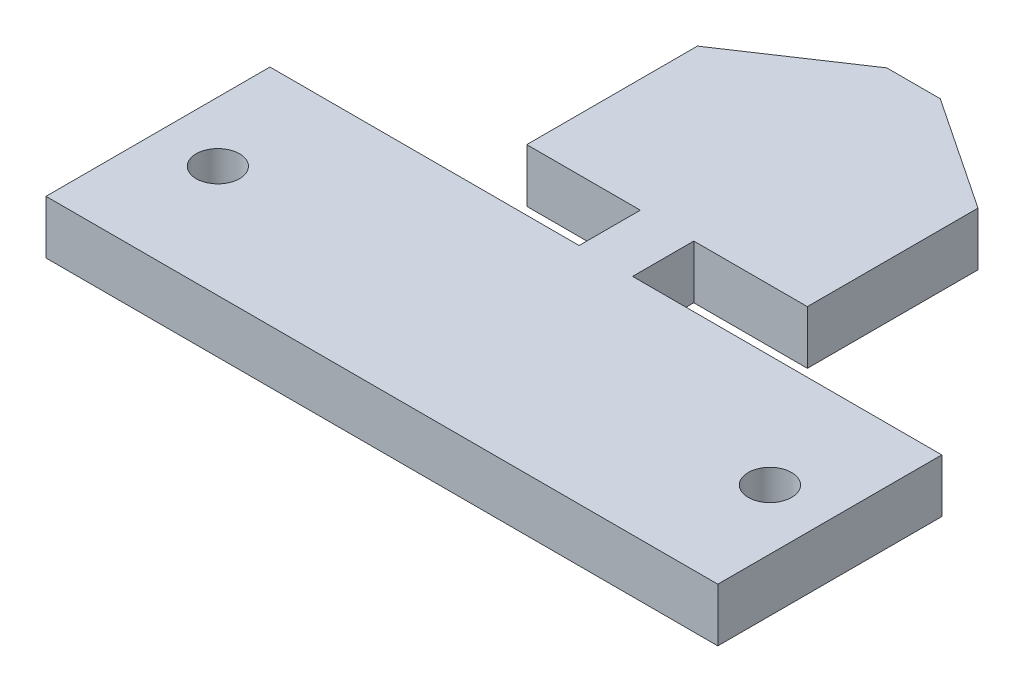
ISO-10303-21;
HEADER;
FILE_DESCRIPTION(('STEP AP214'),'2;1');
FILE_NAME('part.step','',(''),(''),'','','');
FILE_SCHEMA(('AUTOMOTIVE_DESIGN { 1 0 10303 214 1 1 1 1 }'));
ENDSEC;
DATA;
#1=APPLICATION_CONTEXT('core data for automotive mechanical design processes');
#2=APPLICATION_PROTOCOL_DEFINITION('international standard','automotive_design',2000,#1);
#3=PRODUCT_CONTEXT('',#1,'mechanical');
#4=PRODUCT('Part','Part','',(#3));
#5=PRODUCT_RELATED_PRODUCT_CATEGORY('part','',(#4));
#6=PRODUCT_DEFINITION_FORMATION('','',#4);
#7=PRODUCT_DEFINITION_CONTEXT('part definition',#1,'design');
#8=PRODUCT_DEFINITION('design','',#6,#7);
#9=PRODUCT_DEFINITION_SHAPE('','',#8);
#10=(LENGTH_UNIT() NAMED_UNIT(*) SI_UNIT(.MILLI.,.METRE.));
#11=(NAMED_UNIT(*) PLANE_ANGLE_UNIT() SI_UNIT($,.RADIAN.));
#12=(NAMED_UNIT(*) SI_UNIT($,.STERADIAN.) SOLID_ANGLE_UNIT());
#13=UNCERTAINTY_MEASURE_WITH_UNIT(LENGTH_MEASURE(1.E-05),#10,'distance_accuracy_value','');
#14=(GEOMETRIC_REPRESENTATION_CONTEXT(3) GLOBAL_UNCERTAINTY_ASSIGNED_CONTEXT((#13)) GLOBAL_UNIT_ASSIGNED_CONTEXT((#10,
#11,#12)) REPRESENTATION_CONTEXT('',''));
#15=CARTESIAN_POINT('',(0.,0.,0.));
#16=DIRECTION('',(0.,0.,1.));
#17=DIRECTION('',(1.,0.,0.));
#18=AXIS2_PLACEMENT_3D('',#15,#16,#17);
#19=CARTESIAN_POINT('',(0.,3.5814,17.05));
#20=DIRECTION('',(0.,0.,-1.));
#21=DIRECTION('',(-1.,0.,0.));
#22=AXIS2_PLACEMENT_3D('',#19,#20,#21);
#23=PLANE('',#22);
#24=DIRECTION('',(1.,0.,0.));
#25=VECTOR('',#24,1.);
#26=CARTESIAN_POINT('',(0.,0.,17.05));
#27=LINE('',#26,#25);
#28=CARTESIAN_POINT('',(-22.5,0.,17.05));
#29=VERTEX_POINT('',#28);
#30=CARTESIAN_POINT('',(22.5,0.,17.05));
#31=VERTEX_POINT('',#30);
#32=EDGE_CURVE('E143',#29,#31,#27,.T.);
#33=ORIENTED_EDGE('',*,*,#32,.T.);
#34=DIRECTION('',(0.,-1.,0.));
#35=VECTOR('',#34,1.);
#36=CARTESIAN_POINT('',(22.5,3.5814,17.05));
#37=LINE('',#36,#35);
#38=CARTESIAN_POINT('',(22.5,3.5814,17.05));
#39=VERTEX_POINT('',#38);
#40=EDGE_CURVE('E11',#39,#31,#37,.T.);
#41=ORIENTED_EDGE('',*,*,#40,.F.);
#42=DIRECTION('',(1.,0.,0.));
#43=VECTOR('',#42,1.);
#44=CARTESIAN_POINT('',(0.,3.5814,17.05));
#45=LINE('',#44,#43);
#46=CARTESIAN_POINT('',(-22.5,3.5814,17.05));
#47=VERTEX_POINT('',#46);
#48=EDGE_CURVE('E165',#47,#39,#45,.T.);
#49=ORIENTED_EDGE('',*,*,#48,.F.);
#50=DIRECTION('',(0.,-1.,0.));
#51=VECTOR('',#50,1.);
#52=CARTESIAN_POINT('',(-22.5,3.5814,17.05));
#53=LINE('',#52,#51);
#54=EDGE_CURVE('E142',#47,#29,#53,.T.);
#55=ORIENTED_EDGE('',*,*,#54,.T.);
#56=EDGE_LOOP('',(#33,#41,#49,#55));
#57=FACE_BOUND('',#56,.T.);
#58=ADVANCED_FACE('F39',(#57),#23,.F.);
#59=CARTESIAN_POINT('',(22.5,3.5814,0.));
#60=DIRECTION('',(-1.,0.,0.));
#61=DIRECTION('',(0.,0.,1.));
#62=AXIS2_PLACEMENT_3D('',#59,#60,#61);
#63=PLANE('',#62);
#64=DIRECTION('',(0.,0.,-1.));
#65=VECTOR('',#64,1.);
#66=CARTESIAN_POINT('',(22.5,0.,0.));
#67=LINE('',#66,#65);
#68=CARTESIAN_POINT('',(22.5,0.,2.05));
#69=VERTEX_POINT('',#68);
#70=EDGE_CURVE('E146',#31,#69,#67,.T.);
#71=ORIENTED_EDGE('',*,*,#70,.T.);
#72=DIRECTION('',(0.,-1.,0.));
#73=VECTOR('',#72,1.);
#74=CARTESIAN_POINT('',(22.5,3.5814,2.05));
#75=LINE('',#74,#73);
#76=CARTESIAN_POINT('',(22.5,3.5814,2.05));
#77=VERTEX_POINT('',#76);
#78=EDGE_CURVE('E47',#77,#69,#75,.T.);
#79=ORIENTED_EDGE('',*,*,#78,.F.);
#80=DIRECTION('',(0.,0.,-1.));
#81=VECTOR('',#80,1.);
#82=CARTESIAN_POINT('',(22.5,3.5814,0.));
#83=LINE('',#82,#81);
#84=EDGE_CURVE('E101',#39,#77,#83,.T.);
#85=ORIENTED_EDGE('',*,*,#84,.F.);
#86=ORIENTED_EDGE('',*,*,#40,.T.);
#87=EDGE_LOOP('',(#71,#79,#85,#86));
#88=FACE_BOUND('',#87,.T.);
#89=ADVANCED_FACE('F183',(#88),#63,.F.);
#90=CARTESIAN_POINT('',(0.,3.5814,2.05));
#91=DIRECTION('',(0.,0.,-1.));
#92=DIRECTION('',(-1.,0.,0.));
#93=AXIS2_PLACEMENT_3D('',#90,#91,#92);
#94=PLANE('',#93);
#95=DIRECTION('',(1.,0.,0.));
#96=VECTOR('',#95,1.);
#97=CARTESIAN_POINT('',(0.,0.,2.05));
#98=LINE('',#97,#96);
#99=CARTESIAN_POINT('',(1.7907,0.,2.05));
#100=VERTEX_POINT('',#99);
#101=EDGE_CURVE('E150',#100,#69,#98,.T.);
#102=ORIENTED_EDGE('',*,*,#101,.F.);
#103=DIRECTION('',(0.,-1.,0.));
#104=VECTOR('',#103,1.);
#105=CARTESIAN_POINT('',(1.7907,3.5814,2.05));
#106=LINE('',#105,#104);
#107=CARTESIAN_POINT('',(1.7907,3.5814,2.05));
#108=VERTEX_POINT('',#107);
#109=EDGE_CURVE('E176',#108,#100,#106,.T.);
#110=ORIENTED_EDGE('',*,*,#109,.F.);
#111=DIRECTION('',(1.,0.,0.));
#112=VECTOR('',#111,1.);
#113=CARTESIAN_POINT('',(0.,3.5814,2.05));
#114=LINE('',#113,#112);
#115=EDGE_CURVE('E182',#108,#77,#114,.T.);
#116=ORIENTED_EDGE('',*,*,#115,.T.);
#117=ORIENTED_EDGE('',*,*,#78,.T.);
#118=EDGE_LOOP('',(#102,#110,#116,#117));
#119=FACE_BOUND('',#118,.T.);
#120=ADVANCED_FACE('F180',(#119),#94,.T.);
#121=CARTESIAN_POINT('',(1.7907,3.5814,0.));
#122=DIRECTION('',(-1.,0.,0.));
#123=DIRECTION('',(0.,0.,1.));
#124=AXIS2_PLACEMENT_3D('',#121,#122,#123);
#125=PLANE('',#124);
#126=DIRECTION('',(0.,0.,-1.));
#127=VECTOR('',#126,1.);
#128=CARTESIAN_POINT('',(1.7907,0.,0.));
#129=LINE('',#128,#127);
#130=CARTESIAN_POINT('',(1.7907,0.,-2.05));
#131=VERTEX_POINT('',#130);
#132=EDGE_CURVE('E153',#100,#131,#129,.T.);
#133=ORIENTED_EDGE('',*,*,#132,.T.);
#134=DIRECTION('',(0.,-1.,0.));
#135=VECTOR('',#134,1.);
#136=CARTESIAN_POINT('',(1.7907,3.5814,-2.05));
#137=LINE('',#136,#135);
#138=CARTESIAN_POINT('',(1.7907,3.5814,-2.05));
#139=VERTEX_POINT('',#138);
#140=EDGE_CURVE('E174',#139,#131,#137,.T.);
#141=ORIENTED_EDGE('',*,*,#140,.F.);
#142=DIRECTION('',(0.,0.,-1.));
#143=VECTOR('',#142,1.);
#144=CARTESIAN_POINT('',(1.7907,3.5814,0.));
#145=LINE('',#144,#143);
#146=EDGE_CURVE('E196',#108,#139,#145,.T.);
#147=ORIENTED_EDGE('',*,*,#146,.F.);
#148=ORIENTED_EDGE('',*,*,#109,.T.);
#149=EDGE_LOOP('',(#133,#141,#147,#148));
#150=FACE_BOUND('',#149,.T.);
#151=ADVANCED_FACE('F193',(#150),#125,.F.);
#152=CARTESIAN_POINT('',(0.,3.5814,-2.05));
#153=DIRECTION('',(0.,0.,1.));
#154=DIRECTION('',(1.,0.,0.));
#155=AXIS2_PLACEMENT_3D('',#152,#153,#154);
#156=PLANE('',#155);
#157=DIRECTION('',(-1.,0.,0.));
#158=VECTOR('',#157,1.);
#159=CARTESIAN_POINT('',(0.,0.,-2.05));
#160=LINE('',#159,#158);
#161=CARTESIAN_POINT('',(9.398,0.,-2.05));
#162=VERTEX_POINT('',#161);
#163=EDGE_CURVE('E156',#162,#131,#160,.T.);
#164=ORIENTED_EDGE('',*,*,#163,.F.);
#165=DIRECTION('',(0.,-1.,0.));
#166=VECTOR('',#165,1.);
#167=CARTESIAN_POINT('',(9.398,3.5814,-2.05));
#168=LINE('',#167,#166);
#169=CARTESIAN_POINT('',(9.398,3.5814,-2.05));
#170=VERTEX_POINT('',#169);
#171=EDGE_CURVE('E172',#170,#162,#168,.T.);
#172=ORIENTED_EDGE('',*,*,#171,.F.);
#173=DIRECTION('',(-1.,0.,0.));
#174=VECTOR('',#173,1.);
#175=CARTESIAN_POINT('',(0.,3.5814,-2.05));
#176=LINE('',#175,#174);
#177=EDGE_CURVE('E137',#170,#139,#176,.T.);
#178=ORIENTED_EDGE('',*,*,#177,.T.);
#179=ORIENTED_EDGE('',*,*,#140,.T.);
#180=EDGE_LOOP('',(#164,#172,#178,#179));
#181=FACE_BOUND('',#180,.T.);
#182=ADVANCED_FACE('F204',(#181),#156,.T.);
#183=CARTESIAN_POINT('',(0.,3.5814,-2.05));
#184=DIRECTION('',(0.,0.,1.));
#185=DIRECTION('',(1.,0.,0.));
#186=AXIS2_PLACEMENT_3D('',#183,#184,#185);
#187=PLANE('',#186);
#188=DIRECTION('',(-1.,0.,0.));
#189=VECTOR('',#188,1.);
#190=CARTESIAN_POINT('',(0.,0.,-2.05));
#191=LINE('',#190,#189);
#192=CARTESIAN_POINT('',(-1.7907,0.,-2.05));
#193=VERTEX_POINT('',#192);
#194=CARTESIAN_POINT('',(-9.398,0.,-2.05));
#195=VERTEX_POINT('',#194);
#196=EDGE_CURVE('E159',#193,#195,#191,.T.);
#197=ORIENTED_EDGE('',*,*,#196,.F.);
#198=DIRECTION('',(0.,-1.,0.));
#199=VECTOR('',#198,1.);
#200=CARTESIAN_POINT('',(-1.7907,3.5814,-2.05));
#201=LINE('',#200,#199);
#202=CARTESIAN_POINT('',(-1.7907,3.5814,-2.05));
#203=VERTEX_POINT('',#202);
#204=EDGE_CURVE('E125',#203,#193,#201,.T.);
#205=ORIENTED_EDGE('',*,*,#204,.F.);
#206=DIRECTION('',(-1.,0.,0.));
#207=VECTOR('',#206,1.);
#208=CARTESIAN_POINT('',(0.,3.5814,-2.05));
#209=LINE('',#208,#207);
#210=CARTESIAN_POINT('',(-9.398,3.5814,-2.05));
#211=VERTEX_POINT('',#210);
#212=EDGE_CURVE('E135',#203,#211,#209,.T.);
#213=ORIENTED_EDGE('',*,*,#212,.T.);
#214=DIRECTION('',(0.,-1.,0.));
#215=VECTOR('',#214,1.);
#216=CARTESIAN_POINT('',(-9.398,3.5814,-2.05));
#217=LINE('',#216,#215);
#218=EDGE_CURVE('E169',#211,#195,#217,.T.);
#219=ORIENTED_EDGE('',*,*,#218,.T.);
#220=EDGE_LOOP('',(#197,#205,#213,#219));
#221=FACE_BOUND('',#220,.T.);
#222=ADVANCED_FACE('F246',(#221),#187,.T.);
#223=CARTESIAN_POINT('',(-1.7907,3.5814,0.));
#224=DIRECTION('',(-1.,0.,0.));
#225=DIRECTION('',(0.,0.,1.));
#226=AXIS2_PLACEMENT_3D('',#223,#224,#225);
#227=PLANE('',#226);
#228=DIRECTION('',(0.,0.,-1.));
#229=VECTOR('',#228,1.);
#230=CARTESIAN_POINT('',(-1.7907,0.,0.));
#231=LINE('',#230,#229);
#232=CARTESIAN_POINT('',(-1.7907,0.,2.05));
#233=VERTEX_POINT('',#232);
#234=EDGE_CURVE('E124',#233,#193,#231,.T.);
#235=ORIENTED_EDGE('',*,*,#234,.F.);
#236=DIRECTION('',(0.,-1.,0.));
#237=VECTOR('',#236,1.);
#238=CARTESIAN_POINT('',(-1.7907,3.5814,2.05));
#239=LINE('',#238,#237);
#240=CARTESIAN_POINT('',(-1.7907,3.5814,2.05));
#241=VERTEX_POINT('',#240);
#242=EDGE_CURVE('E118',#241,#233,#239,.T.);
#243=ORIENTED_EDGE('',*,*,#242,.F.);
#244=DIRECTION('',(0.,0.,-1.));
#245=VECTOR('',#244,1.);
#246=CARTESIAN_POINT('',(-1.7907,3.5814,0.));
#247=LINE('',#246,#245);
#248=EDGE_CURVE('E122',#241,#203,#247,.T.);
#249=ORIENTED_EDGE('',*,*,#248,.T.);
#250=ORIENTED_EDGE('',*,*,#204,.T.);
#251=EDGE_LOOP('',(#235,#243,#249,#250));
#252=FACE_BOUND('',#251,.T.);
#253=ADVANCED_FACE('F120',(#252),#227,.T.);
#254=CARTESIAN_POINT('',(0.,3.5814,2.05));
#255=DIRECTION('',(0.,0.,1.));
#256=DIRECTION('',(1.,0.,0.));
#257=AXIS2_PLACEMENT_3D('',#254,#255,#256);
#258=PLANE('',#257);
#259=DIRECTION('',(-1.,0.,0.));
#260=VECTOR('',#259,1.);
#261=CARTESIAN_POINT('',(0.,0.,2.05));
#262=LINE('',#261,#260);
#263=CARTESIAN_POINT('',(-22.5,0.,2.05));
#264=VERTEX_POINT('',#263);
#265=EDGE_CURVE('E87',#233,#264,#262,.T.);
#266=ORIENTED_EDGE('',*,*,#265,.T.);
#267=DIRECTION('',(0.,-1.,0.));
#268=VECTOR('',#267,1.);
#269=CARTESIAN_POINT('',(-22.5,3.5814,2.05));
#270=LINE('',#269,#268);
#271=CARTESIAN_POINT('',(-22.5,3.5814,2.05));
#272=VERTEX_POINT('',#271);
#273=EDGE_CURVE('E126',#272,#264,#270,.T.);
#274=ORIENTED_EDGE('',*,*,#273,.F.);
#275=DIRECTION('',(-1.,0.,0.));
#276=VECTOR('',#275,1.);
#277=CARTESIAN_POINT('',(0.,3.5814,2.05));
#278=LINE('',#277,#276);
#279=EDGE_CURVE('E128',#241,#272,#278,.T.);
#280=ORIENTED_EDGE('',*,*,#279,.F.);
#281=ORIENTED_EDGE('',*,*,#242,.T.);
#282=EDGE_LOOP('',(#266,#274,#280,#281));
#283=FACE_BOUND('',#282,.T.);
#284=ADVANCED_FACE('F129',(#283),#258,.F.);
#285=CARTESIAN_POINT('',(-22.5,3.5814,0.));
#286=DIRECTION('',(1.,0.,0.));
#287=DIRECTION('',(0.,0.,-1.));
#288=AXIS2_PLACEMENT_3D('',#285,#286,#287);
#289=PLANE('',#288);
#290=DIRECTION('',(0.,0.,1.));
#291=VECTOR('',#290,1.);
#292=CARTESIAN_POINT('',(-22.5,0.,0.));
#293=LINE('',#292,#291);
#294=EDGE_CURVE('E93',#264,#29,#293,.T.);
#295=ORIENTED_EDGE('',*,*,#294,.T.);
#296=ORIENTED_EDGE('',*,*,#54,.F.);
#297=DIRECTION('',(0.,0.,1.));
#298=VECTOR('',#297,1.);
#299=CARTESIAN_POINT('',(-22.5,3.5814,0.));
#300=LINE('',#299,#298);
#301=EDGE_CURVE('E55',#272,#47,#300,.T.);
#302=ORIENTED_EDGE('',*,*,#301,.F.);
#303=ORIENTED_EDGE('',*,*,#273,.T.);
#304=EDGE_LOOP('',(#295,#296,#302,#303));
#305=FACE_BOUND('',#304,.T.);
#306=ADVANCED_FACE('F249',(#305),#289,.F.);
#307=CARTESIAN_POINT('',(0.,3.5814,0.));
#308=DIRECTION('',(0.,1.,0.));
#309=DIRECTION('',(0.,0.,1.));
#310=AXIS2_PLACEMENT_3D('',#307,#308,#309);
#311=PLANE('',#310);
#312=CARTESIAN_POINT('',(-18.49,3.5814,9.55));
#313=DIRECTION('',(0.,1.,0.));
#314=DIRECTION('',(0.,0.,1.));
#315=AXIS2_PLACEMENT_3D('',#312,#313,#314);
#316=CIRCLE('',#315,1.45);
#317=CARTESIAN_POINT('',(-18.49,3.5814,11.));
#318=VERTEX_POINT('',#317);
#319=EDGE_CURVE('E438',#318,#318,#316,.T.);
#320=ORIENTED_EDGE('',*,*,#319,.F.);
#321=EDGE_LOOP('',(#320));
#322=FACE_BOUND('',#321,.T.);
#323=CARTESIAN_POINT('',(18.49,3.5814,9.54999999999999));
#324=DIRECTION('',(0.,1.,0.));
#325=DIRECTION('',(0.,0.,1.));
#326=AXIS2_PLACEMENT_3D('',#323,#324,#325);
#327=CIRCLE('',#326,1.45);
#328=CARTESIAN_POINT('',(18.49,3.5814,11.));
#329=VERTEX_POINT('',#328);
#330=EDGE_CURVE('E414',#329,#329,#327,.T.);
#331=ORIENTED_EDGE('',*,*,#330,.F.);
#332=EDGE_LOOP('',(#331));
#333=FACE_BOUND('',#332,.T.);
#334=ORIENTED_EDGE('',*,*,#48,.T.);
#335=ORIENTED_EDGE('',*,*,#84,.T.);
#336=ORIENTED_EDGE('',*,*,#115,.F.);
#337=ORIENTED_EDGE('',*,*,#146,.T.);
#338=ORIENTED_EDGE('',*,*,#177,.F.);
#339=DIRECTION('',(0.,0.,1.));
#340=VECTOR('',#339,1.);
#341=CARTESIAN_POINT('',(9.398,3.5814,0.));
#342=LINE('',#341,#340);
#343=CARTESIAN_POINT('',(9.398,3.5814,-13.48));
#344=VERTEX_POINT('',#343);
#345=EDGE_CURVE('E210',#344,#170,#342,.T.);
#346=ORIENTED_EDGE('',*,*,#345,.F.);
#347=DIRECTION('',(0.831622862362014,0.,0.555340809590661));
#348=VECTOR('',#347,1.);
#349=CARTESIAN_POINT('',(9.12389914437328,3.5814,-13.663038968699));
#350=LINE('',#349,#348);
#351=CARTESIAN_POINT('',(1.7907,3.5814,-18.56));
#352=VERTEX_POINT('',#351);
#353=EDGE_CURVE('E410',#352,#344,#350,.T.);
#354=ORIENTED_EDGE('',*,*,#353,.F.);
#355=DIRECTION('',(1.,0.,0.));
#356=VECTOR('',#355,1.);
#357=CARTESIAN_POINT('',(0.,3.5814,-18.56));
#358=LINE('',#357,#356);
#359=CARTESIAN_POINT('',(-1.7907,3.5814,-18.56));
#360=VERTEX_POINT('',#359);
#361=EDGE_CURVE('E419',#360,#352,#358,.T.);
#362=ORIENTED_EDGE('',*,*,#361,.F.);
#363=DIRECTION('',(0.831622862362014,0.,-0.555340809590661));
#364=VECTOR('',#363,1.);
#365=CARTESIAN_POINT('',(-9.12389914437328,3.5814,-13.663038968699));
#366=LINE('',#365,#364);
#367=CARTESIAN_POINT('',(-9.398,3.5814,-13.48));
#368=VERTEX_POINT('',#367);
#369=EDGE_CURVE('E422',#368,#360,#366,.T.);
#370=ORIENTED_EDGE('',*,*,#369,.F.);
#371=DIRECTION('',(0.,0.,-1.));
#372=VECTOR('',#371,1.);
#373=CARTESIAN_POINT('',(-9.398,3.5814,0.));
#374=LINE('',#373,#372);
#375=EDGE_CURVE('E425',#211,#368,#374,.T.);
#376=ORIENTED_EDGE('',*,*,#375,.F.);
#377=ORIENTED_EDGE('',*,*,#212,.F.);
#378=ORIENTED_EDGE('',*,*,#248,.F.);
#379=ORIENTED_EDGE('',*,*,#279,.T.);
#380=ORIENTED_EDGE('',*,*,#301,.T.);
#381=EDGE_LOOP('',(#334,#335,#336,#337,#338,#346,#354,#362,#370,#376,#377,#378,#379,#380));
#382=FACE_BOUND('',#381,.T.);
#383=ADVANCED_FACE('F132',(#322,#333,#382),#311,.T.);
#384=CARTESIAN_POINT('',(0.,0.,0.));
#385=DIRECTION('',(0.,1.,0.));
#386=DIRECTION('',(0.,0.,1.));
#387=AXIS2_PLACEMENT_3D('',#384,#385,#386);
#388=PLANE('',#387);
#389=CARTESIAN_POINT('',(-18.49,0.,9.55));
#390=DIRECTION('',(0.,1.,0.));
#391=DIRECTION('',(0.,0.,1.));
#392=AXIS2_PLACEMENT_3D('',#389,#390,#391);
#393=CIRCLE('',#392,1.45);
#394=CARTESIAN_POINT('',(-18.49,0.,11.));
#395=VERTEX_POINT('',#394);
#396=EDGE_CURVE('E147',#395,#395,#393,.T.);
#397=ORIENTED_EDGE('',*,*,#396,.T.);
#398=EDGE_LOOP('',(#397));
#399=FACE_BOUND('',#398,.T.);
#400=CARTESIAN_POINT('',(18.49,0.,9.54999999999999));
#401=DIRECTION('',(0.,1.,0.));
#402=DIRECTION('',(0.,0.,1.));
#403=AXIS2_PLACEMENT_3D('',#400,#401,#402);
#404=CIRCLE('',#403,1.45);
#405=CARTESIAN_POINT('',(18.49,0.,11.));
#406=VERTEX_POINT('',#405);
#407=EDGE_CURVE('E441',#406,#406,#404,.T.);
#408=ORIENTED_EDGE('',*,*,#407,.T.);
#409=EDGE_LOOP('',(#408));
#410=FACE_BOUND('',#409,.T.);
#411=ORIENTED_EDGE('',*,*,#32,.F.);
#412=ORIENTED_EDGE('',*,*,#294,.F.);
#413=ORIENTED_EDGE('',*,*,#265,.F.);
#414=ORIENTED_EDGE('',*,*,#234,.T.);
#415=ORIENTED_EDGE('',*,*,#196,.T.);
#416=DIRECTION('',(0.,0.,1.));
#417=VECTOR('',#416,1.);
#418=CARTESIAN_POINT('',(-9.398,0.,0.));
#419=LINE('',#418,#417);
#420=CARTESIAN_POINT('',(-9.398,0.,-13.48));
#421=VERTEX_POINT('',#420);
#422=EDGE_CURVE('E233',#421,#195,#419,.T.);
#423=ORIENTED_EDGE('',*,*,#422,.F.);
#424=DIRECTION('',(-0.831622862362014,0.,0.555340809590661));
#425=VECTOR('',#424,1.);
#426=CARTESIAN_POINT('',(-9.12389914437328,0.,-13.663038968699));
#427=LINE('',#426,#425);
#428=CARTESIAN_POINT('',(-1.7907,0.,-18.56));
#429=VERTEX_POINT('',#428);
#430=EDGE_CURVE('E242',#429,#421,#427,.T.);
#431=ORIENTED_EDGE('',*,*,#430,.F.);
#432=DIRECTION('',(-1.,0.,0.));
#433=VECTOR('',#432,1.);
#434=CARTESIAN_POINT('',(0.,0.,-18.56));
#435=LINE('',#434,#433);
#436=CARTESIAN_POINT('',(1.7907,0.,-18.56));
#437=VERTEX_POINT('',#436);
#438=EDGE_CURVE('E411',#437,#429,#435,.T.);
#439=ORIENTED_EDGE('',*,*,#438,.F.);
#440=DIRECTION('',(-0.831622862362014,0.,-0.555340809590661));
#441=VECTOR('',#440,1.);
#442=CARTESIAN_POINT('',(9.12389914437328,0.,-13.663038968699));
#443=LINE('',#442,#441);
#444=CARTESIAN_POINT('',(9.398,0.,-13.48));
#445=VERTEX_POINT('',#444);
#446=EDGE_CURVE('E408',#445,#437,#443,.T.);
#447=ORIENTED_EDGE('',*,*,#446,.F.);
#448=DIRECTION('',(0.,0.,-1.));
#449=VECTOR('',#448,1.);
#450=CARTESIAN_POINT('',(9.398,0.,0.));
#451=LINE('',#450,#449);
#452=EDGE_CURVE('E241',#162,#445,#451,.T.);
#453=ORIENTED_EDGE('',*,*,#452,.F.);
#454=ORIENTED_EDGE('',*,*,#163,.T.);
#455=ORIENTED_EDGE('',*,*,#132,.F.);
#456=ORIENTED_EDGE('',*,*,#101,.T.);
#457=ORIENTED_EDGE('',*,*,#70,.F.);
#458=EDGE_LOOP('',(#411,#412,#413,#414,#415,#423,#431,#439,#447,#453,#454,#455,#456,#457));
#459=FACE_BOUND('',#458,.T.);
#460=ADVANCED_FACE('F188',(#399,#410,#459),#388,.F.);
#461=CARTESIAN_POINT('',(18.49,0.,9.54999999999999));
#462=DIRECTION('',(0.,1.,0.));
#463=DIRECTION('',(0.,0.,1.));
#464=AXIS2_PLACEMENT_3D('',#461,#462,#463);
#465=CYLINDRICAL_SURFACE('',#464,1.45);
#466=ORIENTED_EDGE('',*,*,#407,.F.);
#467=EDGE_LOOP('',(#466));
#468=FACE_BOUND('',#467,.T.);
#469=ORIENTED_EDGE('',*,*,#330,.T.);
#470=EDGE_LOOP('',(#469));
#471=FACE_BOUND('',#470,.T.);
#472=ADVANCED_FACE('F298',(#468,#471),#465,.F.);
#473=CARTESIAN_POINT('',(-18.49,0.,9.55));
#474=DIRECTION('',(0.,1.,0.));
#475=DIRECTION('',(0.,0.,1.));
#476=AXIS2_PLACEMENT_3D('',#473,#474,#475);
#477=CYLINDRICAL_SURFACE('',#476,1.45);
#478=ORIENTED_EDGE('',*,*,#396,.F.);
#479=EDGE_LOOP('',(#478));
#480=FACE_BOUND('',#479,.T.);
#481=ORIENTED_EDGE('',*,*,#319,.T.);
#482=EDGE_LOOP('',(#481));
#483=FACE_BOUND('',#482,.T.);
#484=ADVANCED_FACE('F302',(#480,#483),#477,.F.);
#485=CARTESIAN_POINT('',(0.,-25.0173882729593,-18.56));
#486=DIRECTION('',(0.,0.,1.));
#487=DIRECTION('',(1.,0.,0.));
#488=AXIS2_PLACEMENT_3D('',#485,#486,#487);
#489=PLANE('',#488);
#490=DIRECTION('',(0.,1.,0.));
#491=VECTOR('',#490,1.);
#492=CARTESIAN_POINT('',(1.7907,-25.0173882729593,-18.56));
#493=LINE('',#492,#491);
#494=EDGE_CURVE('E427',#437,#352,#493,.T.);
#495=ORIENTED_EDGE('',*,*,#494,.F.);
#496=ORIENTED_EDGE('',*,*,#438,.T.);
#497=DIRECTION('',(0.,1.,0.));
#498=VECTOR('',#497,1.);
#499=CARTESIAN_POINT('',(-1.7907,-25.0173882729593,-18.56));
#500=LINE('',#499,#498);
#501=EDGE_CURVE('E430',#429,#360,#500,.T.);
#502=ORIENTED_EDGE('',*,*,#501,.T.);
#503=ORIENTED_EDGE('',*,*,#361,.T.);
#504=EDGE_LOOP('',(#495,#496,#502,#503));
#505=FACE_BOUND('',#504,.T.);
#506=ADVANCED_FACE('F312',(#505),#489,.F.);
#507=CARTESIAN_POINT('',(-9.12389914437328,-25.0173882729593,-13.663038968699));
#508=DIRECTION('',(0.555340809590661,0.,0.831622862362014));
#509=DIRECTION('',(0.831622862362014,0.,-0.555340809590661));
#510=AXIS2_PLACEMENT_3D('',#507,#508,#509);
#511=PLANE('',#510);
#512=ORIENTED_EDGE('',*,*,#501,.F.);
#513=ORIENTED_EDGE('',*,*,#430,.T.);
#514=DIRECTION('',(0.,1.,0.));
#515=VECTOR('',#514,1.);
#516=CARTESIAN_POINT('',(-9.398,-25.0173882729593,-13.48));
#517=LINE('',#516,#515);
#518=EDGE_CURVE('E239',#421,#368,#517,.T.);
#519=ORIENTED_EDGE('',*,*,#518,.T.);
#520=ORIENTED_EDGE('',*,*,#369,.T.);
#521=EDGE_LOOP('',(#512,#513,#519,#520));
#522=FACE_BOUND('',#521,.T.);
#523=ADVANCED_FACE('F344',(#522),#511,.F.);
#524=CARTESIAN_POINT('',(-9.398,-25.0173882729593,0.));
#525=DIRECTION('',(1.,0.,0.));
#526=DIRECTION('',(0.,0.,-1.));
#527=AXIS2_PLACEMENT_3D('',#524,#525,#526);
#528=PLANE('',#527);
#529=ORIENTED_EDGE('',*,*,#518,.F.);
#530=ORIENTED_EDGE('',*,*,#422,.T.);
#531=ORIENTED_EDGE('',*,*,#218,.F.);
#532=ORIENTED_EDGE('',*,*,#375,.T.);
#533=EDGE_LOOP('',(#529,#530,#531,#532));
#534=FACE_BOUND('',#533,.T.);
#535=ADVANCED_FACE('F236',(#534),#528,.F.);
#536=CARTESIAN_POINT('',(9.398,-25.0173882729593,0.));
#537=DIRECTION('',(-1.,0.,0.));
#538=DIRECTION('',(0.,0.,1.));
#539=AXIS2_PLACEMENT_3D('',#536,#537,#538);
#540=PLANE('',#539);
#541=ORIENTED_EDGE('',*,*,#171,.T.);
#542=ORIENTED_EDGE('',*,*,#452,.T.);
#543=DIRECTION('',(0.,1.,0.));
#544=VECTOR('',#543,1.);
#545=CARTESIAN_POINT('',(9.398,-25.0173882729593,-13.48));
#546=LINE('',#545,#544);
#547=EDGE_CURVE('E405',#445,#344,#546,.T.);
#548=ORIENTED_EDGE('',*,*,#547,.T.);
#549=ORIENTED_EDGE('',*,*,#345,.T.);
#550=EDGE_LOOP('',(#541,#542,#548,#549));
#551=FACE_BOUND('',#550,.T.);
#552=ADVANCED_FACE('F364',(#551),#540,.F.);
#553=CARTESIAN_POINT('',(9.12389914437328,-25.0173882729593,-13.663038968699));
#554=DIRECTION('',(-0.555340809590661,0.,0.831622862362014));
#555=DIRECTION('',(0.831622862362014,0.,0.555340809590661));
#556=AXIS2_PLACEMENT_3D('',#553,#554,#555);
#557=PLANE('',#556);
#558=ORIENTED_EDGE('',*,*,#547,.F.);
#559=ORIENTED_EDGE('',*,*,#446,.T.);
#560=ORIENTED_EDGE('',*,*,#494,.T.);
#561=ORIENTED_EDGE('',*,*,#353,.T.);
#562=EDGE_LOOP('',(#558,#559,#560,#561));
#563=FACE_BOUND('',#562,.T.);
#564=ADVANCED_FACE('F374',(#563),#557,.F.);
#565=CLOSED_SHELL('',(#58,#89,#120,#151,#182,#222,#253,#284,#306,#383,#460,#472,#484,#506,#523,
#535,#552,#564));
#566=MANIFOLD_SOLID_BREP('B2',#565);
#567=ADVANCED_BREP_SHAPE_REPRESENTATION('',(#18,#566),#14);
#568=SHAPE_DEFINITION_REPRESENTATION(#9,#567);
ENDSEC;
END-ISO-10303-21;
